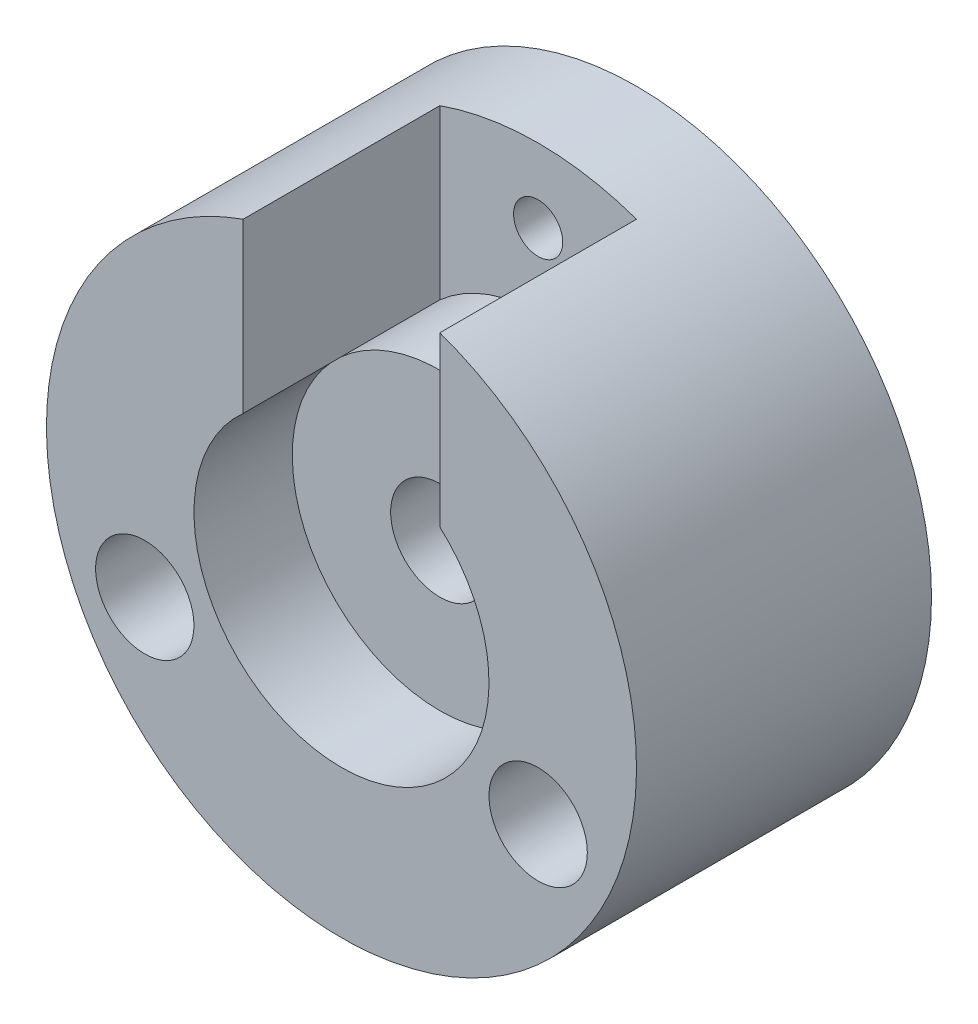
ISO-10303-21;
HEADER;
FILE_DESCRIPTION(('STEP AP214'),'2;1');
FILE_NAME('part.step','',(''),(''),'','','');
FILE_SCHEMA(('AUTOMOTIVE_DESIGN { 1 0 10303 214 1 1 1 1 }'));
ENDSEC;
DATA;
#1=APPLICATION_CONTEXT('core data for automotive mechanical design processes');
#2=APPLICATION_PROTOCOL_DEFINITION('international standard','automotive_design',2000,#1);
#3=PRODUCT_CONTEXT('',#1,'mechanical');
#4=PRODUCT('Part','Part','',(#3));
#5=PRODUCT_RELATED_PRODUCT_CATEGORY('part','',(#4));
#6=PRODUCT_DEFINITION_FORMATION('','',#4);
#7=PRODUCT_DEFINITION_CONTEXT('part definition',#1,'design');
#8=PRODUCT_DEFINITION('design','',#6,#7);
#9=PRODUCT_DEFINITION_SHAPE('','',#8);
#10=(LENGTH_UNIT() NAMED_UNIT(*) SI_UNIT(.MILLI.,.METRE.));
#11=(NAMED_UNIT(*) PLANE_ANGLE_UNIT() SI_UNIT($,.RADIAN.));
#12=(NAMED_UNIT(*) SI_UNIT($,.STERADIAN.) SOLID_ANGLE_UNIT());
#13=UNCERTAINTY_MEASURE_WITH_UNIT(LENGTH_MEASURE(1.E-05),#10,'distance_accuracy_value','');
#14=(GEOMETRIC_REPRESENTATION_CONTEXT(3) GLOBAL_UNCERTAINTY_ASSIGNED_CONTEXT((#13)) GLOBAL_UNIT_ASSIGNED_CONTEXT((#10,
#11,#12)) REPRESENTATION_CONTEXT('',''));
#15=CARTESIAN_POINT('',(0.,0.,0.));
#16=DIRECTION('',(0.,0.,1.));
#17=DIRECTION('',(1.,0.,0.));
#18=AXIS2_PLACEMENT_3D('',#15,#16,#17);
#19=CARTESIAN_POINT('',(0.,0.,10.));
#20=DIRECTION('',(0.,0.,1.));
#21=DIRECTION('',(1.,0.,0.));
#22=AXIS2_PLACEMENT_3D('',#19,#20,#21);
#23=CYLINDRICAL_SURFACE('',#22,5.);
#24=CARTESIAN_POINT('',(0.,0.,20.));
#25=DIRECTION('',(0.,0.,1.));
#26=DIRECTION('',(1.,0.,0.));
#27=AXIS2_PLACEMENT_3D('',#24,#25,#26);
#28=CIRCLE('',#27,5.);
#29=CARTESIAN_POINT('',(5.,0.,20.));
#30=VERTEX_POINT('',#29);
#31=EDGE_CURVE('E119',#30,#30,#28,.T.);
#32=ORIENTED_EDGE('',*,*,#31,.T.);
#33=EDGE_LOOP('',(#32));
#34=FACE_BOUND('',#33,.T.);
#35=CARTESIAN_POINT('',(0.,0.,10.));
#36=DIRECTION('',(0.,0.,-1.));
#37=DIRECTION('',(-1.,0.,0.));
#38=AXIS2_PLACEMENT_3D('',#35,#36,#37);
#39=CIRCLE('',#38,5.);
#40=CARTESIAN_POINT('',(-5.,0.,10.));
#41=VERTEX_POINT('',#40);
#42=EDGE_CURVE('E38',#41,#41,#39,.F.);
#43=ORIENTED_EDGE('',*,*,#42,.F.);
#44=EDGE_LOOP('',(#43));
#45=FACE_BOUND('',#44,.T.);
#46=ADVANCED_FACE('F34',(#34,#45),#23,.F.);
#47=CARTESIAN_POINT('',(0.,0.,30.));
#48=DIRECTION('',(0.,0.,-1.));
#49=DIRECTION('',(-1.,0.,0.));
#50=AXIS2_PLACEMENT_3D('',#47,#48,#49);
#51=CYLINDRICAL_SURFACE('',#50,30.);
#52=CARTESIAN_POINT('',(0.,-1.55778168142717E-12,10.));
#53=DIRECTION('',(0.,0.,1.));
#54=DIRECTION('',(-1.,0.,0.));
#55=AXIS2_PLACEMENT_3D('',#52,#53,#54);
#56=CIRCLE('',#55,30.0000000000015);
#57=CARTESIAN_POINT('',(10.,28.2842712474619,10.));
#58=VERTEX_POINT('',#57);
#59=CARTESIAN_POINT('',(-10.,28.2842712474619,10.));
#60=VERTEX_POINT('',#59);
#61=EDGE_CURVE('E90',#58,#60,#56,.T.);
#62=ORIENTED_EDGE('',*,*,#61,.F.);
#63=DIRECTION('',(0.,0.,1.));
#64=VECTOR('',#63,1.);
#65=CARTESIAN_POINT('',(10.,28.2842712474619,10.));
#66=LINE('',#65,#64);
#67=CARTESIAN_POINT('',(10.,28.2842712474619,30.));
#68=VERTEX_POINT('',#67);
#69=EDGE_CURVE('E114',#58,#68,#66,.T.);
#70=ORIENTED_EDGE('',*,*,#69,.T.);
#71=CARTESIAN_POINT('',(0.,0.,30.));
#72=DIRECTION('',(0.,0.,1.));
#73=DIRECTION('',(1.,0.,0.));
#74=AXIS2_PLACEMENT_3D('',#71,#72,#73);
#75=CIRCLE('',#74,30.);
#76=CARTESIAN_POINT('',(-10.,28.2842712474619,30.));
#77=VERTEX_POINT('',#76);
#78=EDGE_CURVE('E11',#77,#68,#75,.T.);
#79=ORIENTED_EDGE('',*,*,#78,.F.);
#80=DIRECTION('',(0.,0.,1.));
#81=VECTOR('',#80,1.);
#82=CARTESIAN_POINT('',(-10.,28.2842712474619,10.));
#83=LINE('',#82,#81);
#84=EDGE_CURVE('E85',#60,#77,#83,.T.);
#85=ORIENTED_EDGE('',*,*,#84,.F.);
#86=EDGE_LOOP('',(#62,#70,#79,#85));
#87=FACE_BOUND('',#86,.T.);
#88=CARTESIAN_POINT('',(0.,0.,0.));
#89=DIRECTION('',(0.,0.,1.));
#90=DIRECTION('',(1.,0.,0.));
#91=AXIS2_PLACEMENT_3D('',#88,#89,#90);
#92=CIRCLE('',#91,30.);
#93=CARTESIAN_POINT('',(30.,0.,0.));
#94=VERTEX_POINT('',#93);
#95=EDGE_CURVE('E43',#94,#94,#92,.T.);
#96=ORIENTED_EDGE('',*,*,#95,.T.);
#97=EDGE_LOOP('',(#96));
#98=FACE_BOUND('',#97,.T.);
#99=ADVANCED_FACE('F36',(#87,#98),#51,.T.);
#100=CARTESIAN_POINT('',(0.,0.,30.));
#101=DIRECTION('',(0.,0.,1.));
#102=DIRECTION('',(1.,0.,0.));
#103=AXIS2_PLACEMENT_3D('',#100,#101,#102);
#104=PLANE('',#103);
#105=DIRECTION('',(0.,1.,0.));
#106=VECTOR('',#105,1.);
#107=CARTESIAN_POINT('',(10.,28.2842712474619,30.));
#108=LINE('',#107,#106);
#109=CARTESIAN_POINT('',(10.,11.1803398874989,30.));
#110=VERTEX_POINT('',#109);
#111=EDGE_CURVE('E99',#110,#68,#108,.T.);
#112=ORIENTED_EDGE('',*,*,#111,.F.);
#113=CARTESIAN_POINT('',(0.,0.,30.));
#114=DIRECTION('',(0.,0.,1.));
#115=DIRECTION('',(1.,0.,0.));
#116=AXIS2_PLACEMENT_3D('',#113,#114,#115);
#117=CIRCLE('',#116,15.);
#118=CARTESIAN_POINT('',(-10.,11.1803398874989,30.));
#119=VERTEX_POINT('',#118);
#120=EDGE_CURVE('E122',#119,#110,#117,.T.);
#121=ORIENTED_EDGE('',*,*,#120,.F.);
#122=DIRECTION('',(0.,-1.,0.));
#123=VECTOR('',#122,1.);
#124=CARTESIAN_POINT('',(-10.,28.2842712474619,30.));
#125=LINE('',#124,#123);
#126=EDGE_CURVE('E186',#77,#119,#125,.T.);
#127=ORIENTED_EDGE('',*,*,#126,.F.);
#128=ORIENTED_EDGE('',*,*,#78,.T.);
#129=EDGE_LOOP('',(#112,#121,#127,#128));
#130=FACE_BOUND('',#129,.T.);
#131=CARTESIAN_POINT('',(-20.,-10.,30.));
#132=DIRECTION('',(0.,0.,1.));
#133=DIRECTION('',(1.,0.,0.));
#134=AXIS2_PLACEMENT_3D('',#131,#132,#133);
#135=CIRCLE('',#134,5.);
#136=CARTESIAN_POINT('',(-15.,-10.,30.));
#137=VERTEX_POINT('',#136);
#138=EDGE_CURVE('E110',#137,#137,#135,.T.);
#139=ORIENTED_EDGE('',*,*,#138,.F.);
#140=EDGE_LOOP('',(#139));
#141=FACE_BOUND('',#140,.T.);
#142=CARTESIAN_POINT('',(20.,-10.,30.));
#143=DIRECTION('',(0.,0.,1.));
#144=DIRECTION('',(1.,0.,0.));
#145=AXIS2_PLACEMENT_3D('',#142,#143,#144);
#146=CIRCLE('',#145,5.);
#147=CARTESIAN_POINT('',(25.,-10.,30.));
#148=VERTEX_POINT('',#147);
#149=EDGE_CURVE('E115',#148,#148,#146,.T.);
#150=ORIENTED_EDGE('',*,*,#149,.F.);
#151=EDGE_LOOP('',(#150));
#152=FACE_BOUND('',#151,.T.);
#153=ADVANCED_FACE('F161',(#130,#141,#152),#104,.T.);
#154=CARTESIAN_POINT('',(0.,0.,0.));
#155=DIRECTION('',(0.,0.,1.));
#156=DIRECTION('',(1.,0.,0.));
#157=AXIS2_PLACEMENT_3D('',#154,#155,#156);
#158=PLANE('',#157);
#159=CARTESIAN_POINT('',(0.,0.,0.));
#160=DIRECTION('',(0.,0.,-1.));
#161=DIRECTION('',(-1.,0.,0.));
#162=AXIS2_PLACEMENT_3D('',#159,#160,#161);
#163=CIRCLE('',#162,10.);
#164=CARTESIAN_POINT('',(-10.,0.,0.));
#165=VERTEX_POINT('',#164);
#166=EDGE_CURVE('E181',#165,#165,#163,.T.);
#167=ORIENTED_EDGE('',*,*,#166,.F.);
#168=EDGE_LOOP('',(#167));
#169=FACE_BOUND('',#168,.T.);
#170=CARTESIAN_POINT('',(0.,22.5,0.));
#171=DIRECTION('',(0.,0.,1.));
#172=DIRECTION('',(1.,0.,0.));
#173=AXIS2_PLACEMENT_3D('',#170,#171,#172);
#174=CIRCLE('',#173,2.5);
#175=CARTESIAN_POINT('',(2.5,22.5,0.));
#176=VERTEX_POINT('',#175);
#177=EDGE_CURVE('E184',#176,#176,#174,.T.);
#178=ORIENTED_EDGE('',*,*,#177,.T.);
#179=EDGE_LOOP('',(#178));
#180=FACE_BOUND('',#179,.T.);
#181=CARTESIAN_POINT('',(-20.,-10.,0.));
#182=DIRECTION('',(0.,0.,1.));
#183=DIRECTION('',(1.,0.,0.));
#184=AXIS2_PLACEMENT_3D('',#181,#182,#183);
#185=CIRCLE('',#184,5.);
#186=CARTESIAN_POINT('',(-15.,-10.,0.));
#187=VERTEX_POINT('',#186);
#188=EDGE_CURVE('E113',#187,#187,#185,.T.);
#189=ORIENTED_EDGE('',*,*,#188,.T.);
#190=EDGE_LOOP('',(#189));
#191=FACE_BOUND('',#190,.T.);
#192=CARTESIAN_POINT('',(20.,-10.,0.));
#193=DIRECTION('',(0.,0.,1.));
#194=DIRECTION('',(1.,0.,0.));
#195=AXIS2_PLACEMENT_3D('',#192,#193,#194);
#196=CIRCLE('',#195,5.);
#197=CARTESIAN_POINT('',(25.,-10.,0.));
#198=VERTEX_POINT('',#197);
#199=EDGE_CURVE('E118',#198,#198,#196,.T.);
#200=ORIENTED_EDGE('',*,*,#199,.T.);
#201=EDGE_LOOP('',(#200));
#202=FACE_BOUND('',#201,.T.);
#203=ORIENTED_EDGE('',*,*,#95,.F.);
#204=EDGE_LOOP('',(#203));
#205=FACE_BOUND('',#204,.T.);
#206=ADVANCED_FACE('F133',(#169,#180,#191,#202,#205),#158,.F.);
#207=CARTESIAN_POINT('',(0.,0.,20.));
#208=DIRECTION('',(0.,0.,1.));
#209=DIRECTION('',(1.,0.,0.));
#210=AXIS2_PLACEMENT_3D('',#207,#208,#209);
#211=CYLINDRICAL_SURFACE('',#210,15.);
#212=ORIENTED_EDGE('',*,*,#120,.T.);
#213=DIRECTION('',(0.,0.,1.));
#214=VECTOR('',#213,1.);
#215=CARTESIAN_POINT('',(10.,11.1803398874989,10.));
#216=LINE('',#215,#214);
#217=CARTESIAN_POINT('',(10.,11.1803398874989,20.));
#218=VERTEX_POINT('',#217);
#219=EDGE_CURVE('E197',#218,#110,#216,.T.);
#220=ORIENTED_EDGE('',*,*,#219,.F.);
#221=CARTESIAN_POINT('',(0.,0.,20.));
#222=DIRECTION('',(0.,0.,1.));
#223=DIRECTION('',(1.,0.,0.));
#224=AXIS2_PLACEMENT_3D('',#221,#222,#223);
#225=CIRCLE('',#224,15.);
#226=CARTESIAN_POINT('',(-10.,11.1803398874989,20.));
#227=VERTEX_POINT('',#226);
#228=EDGE_CURVE('E124',#227,#218,#225,.T.);
#229=ORIENTED_EDGE('',*,*,#228,.F.);
#230=DIRECTION('',(0.,0.,1.));
#231=VECTOR('',#230,1.);
#232=CARTESIAN_POINT('',(-10.,11.1803398874989,10.));
#233=LINE('',#232,#231);
#234=EDGE_CURVE('E103',#227,#119,#233,.T.);
#235=ORIENTED_EDGE('',*,*,#234,.T.);
#236=EDGE_LOOP('',(#212,#220,#229,#235));
#237=FACE_BOUND('',#236,.T.);
#238=ADVANCED_FACE('F166',(#237),#211,.F.);
#239=CARTESIAN_POINT('',(0.,0.,20.));
#240=DIRECTION('',(0.,0.,1.));
#241=DIRECTION('',(1.,0.,0.));
#242=AXIS2_PLACEMENT_3D('',#239,#240,#241);
#243=PLANE('',#242);
#244=ORIENTED_EDGE('',*,*,#31,.F.);
#245=EDGE_LOOP('',(#244));
#246=FACE_BOUND('',#245,.T.);
#247=EDGE_CURVE('E56',#218,#227,#225,.T.);
#248=ORIENTED_EDGE('',*,*,#247,.T.);
#249=ORIENTED_EDGE('',*,*,#228,.T.);
#250=EDGE_LOOP('',(#248,#249));
#251=FACE_BOUND('',#250,.T.);
#252=ADVANCED_FACE('F149',(#246,#251),#243,.T.);
#253=CARTESIAN_POINT('',(20.,-10.,-80.));
#254=DIRECTION('',(0.,0.,1.));
#255=DIRECTION('',(1.,0.,0.));
#256=AXIS2_PLACEMENT_3D('',#253,#254,#255);
#257=CYLINDRICAL_SURFACE('',#256,5.);
#258=ORIENTED_EDGE('',*,*,#149,.T.);
#259=EDGE_LOOP('',(#258));
#260=FACE_BOUND('',#259,.T.);
#261=ORIENTED_EDGE('',*,*,#199,.F.);
#262=EDGE_LOOP('',(#261));
#263=FACE_BOUND('',#262,.T.);
#264=ADVANCED_FACE('F139',(#260,#263),#257,.F.);
#265=CARTESIAN_POINT('',(-20.,-10.,-80.));
#266=DIRECTION('',(0.,0.,1.));
#267=DIRECTION('',(1.,0.,0.));
#268=AXIS2_PLACEMENT_3D('',#265,#266,#267);
#269=CYLINDRICAL_SURFACE('',#268,5.);
#270=ORIENTED_EDGE('',*,*,#138,.T.);
#271=EDGE_LOOP('',(#270));
#272=FACE_BOUND('',#271,.T.);
#273=ORIENTED_EDGE('',*,*,#188,.F.);
#274=EDGE_LOOP('',(#273));
#275=FACE_BOUND('',#274,.T.);
#276=ADVANCED_FACE('F136',(#272,#275),#269,.F.);
#277=CARTESIAN_POINT('',(10.,28.2842712474619,10.));
#278=DIRECTION('',(1.,0.,0.));
#279=DIRECTION('',(0.,1.,0.));
#280=AXIS2_PLACEMENT_3D('',#277,#278,#279);
#281=PLANE('',#280);
#282=ORIENTED_EDGE('',*,*,#111,.T.);
#283=ORIENTED_EDGE('',*,*,#69,.F.);
#284=DIRECTION('',(0.,1.,0.));
#285=VECTOR('',#284,1.);
#286=CARTESIAN_POINT('',(10.,28.2842712474619,10.));
#287=LINE('',#286,#285);
#288=CARTESIAN_POINT('',(10.,11.1803398874989,10.));
#289=VERTEX_POINT('',#288);
#290=EDGE_CURVE('E96',#289,#58,#287,.T.);
#291=ORIENTED_EDGE('',*,*,#290,.F.);
#292=EDGE_CURVE('E196',#289,#218,#216,.T.);
#293=ORIENTED_EDGE('',*,*,#292,.T.);
#294=ORIENTED_EDGE('',*,*,#219,.T.);
#295=EDGE_LOOP('',(#282,#283,#291,#293,#294));
#296=FACE_BOUND('',#295,.T.);
#297=ADVANCED_FACE('F138',(#296),#281,.F.);
#298=CARTESIAN_POINT('',(0.,0.,10.));
#299=DIRECTION('',(0.,0.,1.));
#300=DIRECTION('',(1.,0.,0.));
#301=AXIS2_PLACEMENT_3D('',#298,#299,#300);
#302=CYLINDRICAL_SURFACE('',#301,15.);
#303=ORIENTED_EDGE('',*,*,#247,.F.);
#304=ORIENTED_EDGE('',*,*,#292,.F.);
#305=CARTESIAN_POINT('',(0.,0.,10.));
#306=DIRECTION('',(0.,0.,-1.));
#307=DIRECTION('',(-1.,0.,0.));
#308=AXIS2_PLACEMENT_3D('',#305,#306,#307);
#309=CIRCLE('',#308,15.);
#310=CARTESIAN_POINT('',(-10.,11.1803398874989,10.));
#311=VERTEX_POINT('',#310);
#312=EDGE_CURVE('E89',#311,#289,#309,.T.);
#313=ORIENTED_EDGE('',*,*,#312,.F.);
#314=EDGE_CURVE('E51',#311,#227,#233,.T.);
#315=ORIENTED_EDGE('',*,*,#314,.T.);
#316=EDGE_LOOP('',(#303,#304,#313,#315));
#317=FACE_BOUND('',#316,.T.);
#318=ADVANCED_FACE('F146',(#317),#302,.T.);
#319=CARTESIAN_POINT('',(-10.,28.2842712474619,10.));
#320=DIRECTION('',(-1.,0.,0.));
#321=DIRECTION('',(0.,-1.,0.));
#322=AXIS2_PLACEMENT_3D('',#319,#320,#321);
#323=PLANE('',#322);
#324=ORIENTED_EDGE('',*,*,#126,.T.);
#325=ORIENTED_EDGE('',*,*,#234,.F.);
#326=ORIENTED_EDGE('',*,*,#314,.F.);
#327=DIRECTION('',(0.,-1.,0.));
#328=VECTOR('',#327,1.);
#329=CARTESIAN_POINT('',(-10.,28.2842712474619,10.));
#330=LINE('',#329,#328);
#331=EDGE_CURVE('E81',#60,#311,#330,.T.);
#332=ORIENTED_EDGE('',*,*,#331,.F.);
#333=ORIENTED_EDGE('',*,*,#84,.T.);
#334=EDGE_LOOP('',(#324,#325,#326,#332,#333));
#335=FACE_BOUND('',#334,.T.);
#336=ADVANCED_FACE('F83',(#335),#323,.F.);
#337=CARTESIAN_POINT('',(0.,-1.55778168142717E-12,10.));
#338=DIRECTION('',(0.,0.,-1.));
#339=DIRECTION('',(-1.,0.,0.));
#340=AXIS2_PLACEMENT_3D('',#337,#338,#339);
#341=PLANE('',#340);
#342=CARTESIAN_POINT('',(0.,22.5,10.));
#343=DIRECTION('',(0.,0.,1.));
#344=DIRECTION('',(1.,0.,0.));
#345=AXIS2_PLACEMENT_3D('',#342,#343,#344);
#346=CIRCLE('',#345,2.5);
#347=CARTESIAN_POINT('',(2.5,22.5,10.));
#348=VERTEX_POINT('',#347);
#349=EDGE_CURVE('E187',#348,#348,#346,.T.);
#350=ORIENTED_EDGE('',*,*,#349,.F.);
#351=EDGE_LOOP('',(#350));
#352=FACE_BOUND('',#351,.T.);
#353=ORIENTED_EDGE('',*,*,#61,.T.);
#354=ORIENTED_EDGE('',*,*,#331,.T.);
#355=ORIENTED_EDGE('',*,*,#312,.T.);
#356=ORIENTED_EDGE('',*,*,#290,.T.);
#357=EDGE_LOOP('',(#353,#354,#355,#356));
#358=FACE_BOUND('',#357,.T.);
#359=ADVANCED_FACE('F94',(#352,#358),#341,.F.);
#360=CARTESIAN_POINT('',(0.,22.5,-10.));
#361=DIRECTION('',(0.,0.,1.));
#362=DIRECTION('',(1.,0.,0.));
#363=AXIS2_PLACEMENT_3D('',#360,#361,#362);
#364=CYLINDRICAL_SURFACE('',#363,2.5);
#365=ORIENTED_EDGE('',*,*,#349,.T.);
#366=EDGE_LOOP('',(#365));
#367=FACE_BOUND('',#366,.T.);
#368=ORIENTED_EDGE('',*,*,#177,.F.);
#369=EDGE_LOOP('',(#368));
#370=FACE_BOUND('',#369,.T.);
#371=ADVANCED_FACE('F220',(#367,#370),#364,.F.);
#372=CARTESIAN_POINT('',(0.,0.,10.));
#373=DIRECTION('',(0.,0.,-1.));
#374=DIRECTION('',(-1.,0.,0.));
#375=AXIS2_PLACEMENT_3D('',#372,#373,#374);
#376=PLANE('',#375);
#377=CARTESIAN_POINT('',(0.,0.,10.));
#378=DIRECTION('',(0.,0.,-1.));
#379=DIRECTION('',(-1.,0.,0.));
#380=AXIS2_PLACEMENT_3D('',#377,#378,#379);
#381=CIRCLE('',#380,10.);
#382=CARTESIAN_POINT('',(-10.,0.,10.));
#383=VERTEX_POINT('',#382);
#384=EDGE_CURVE('E234',#383,#383,#381,.T.);
#385=ORIENTED_EDGE('',*,*,#384,.T.);
#386=EDGE_LOOP('',(#385));
#387=FACE_BOUND('',#386,.T.);
#388=ORIENTED_EDGE('',*,*,#42,.T.);
#389=EDGE_LOOP('',(#388));
#390=FACE_BOUND('',#389,.T.);
#391=ADVANCED_FACE('F223',(#387,#390),#376,.T.);
#392=CARTESIAN_POINT('',(0.,0.,10.));
#393=DIRECTION('',(0.,0.,-1.));
#394=DIRECTION('',(-1.,0.,0.));
#395=AXIS2_PLACEMENT_3D('',#392,#393,#394);
#396=CYLINDRICAL_SURFACE('',#395,10.);
#397=ORIENTED_EDGE('',*,*,#384,.F.);
#398=EDGE_LOOP('',(#397));
#399=FACE_BOUND('',#398,.T.);
#400=ORIENTED_EDGE('',*,*,#166,.T.);
#401=EDGE_LOOP('',(#400));
#402=FACE_BOUND('',#401,.T.);
#403=ADVANCED_FACE('F225',(#399,#402),#396,.F.);
#404=CLOSED_SHELL('',(#46,#99,#153,#206,#238,#252,#264,#276,#297,#318,#336,#359,#371,#391,#403));
#405=MANIFOLD_SOLID_BREP('B2',#404);
#406=ADVANCED_BREP_SHAPE_REPRESENTATION('',(#18,#405),#14);
#407=SHAPE_DEFINITION_REPRESENTATION(#9,#406);
ENDSEC;
END-ISO-10303-21;
